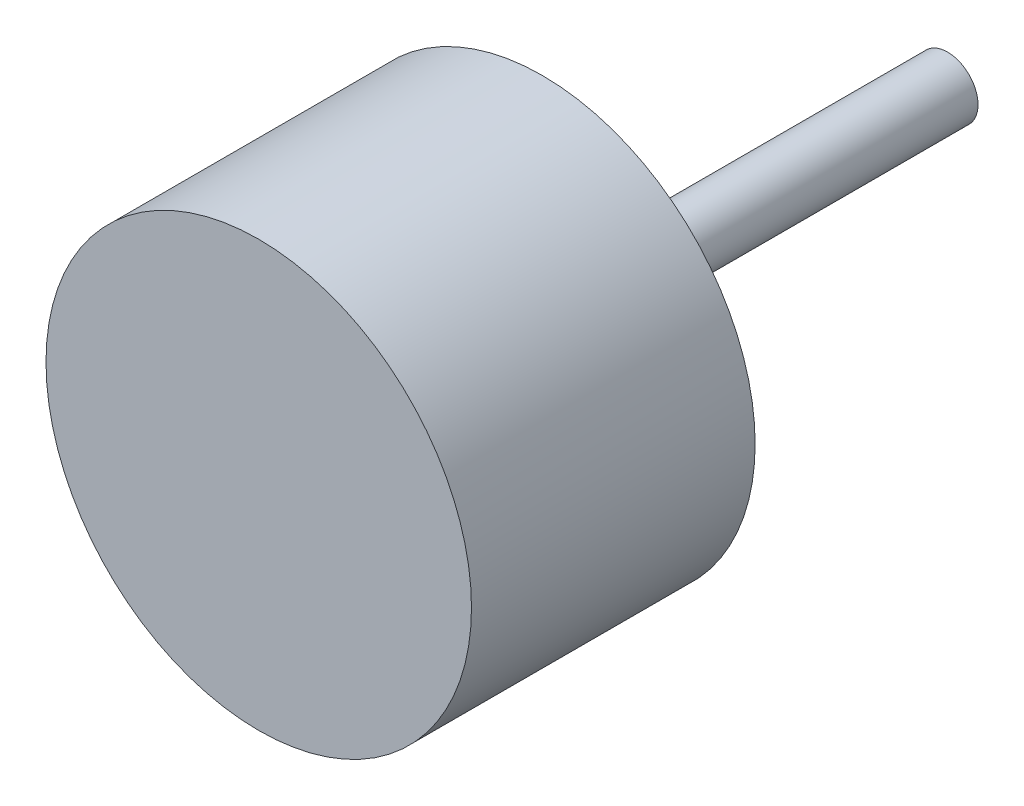
ISO-10303-21;
HEADER;
FILE_DESCRIPTION(('STEP AP214'),'2;1');
FILE_NAME('part.step','',(''),(''),'','','');
FILE_SCHEMA(('AUTOMOTIVE_DESIGN { 1 0 10303 214 1 1 1 1 }'));
ENDSEC;
DATA;
#1=APPLICATION_CONTEXT('core data for automotive mechanical design processes');
#2=APPLICATION_PROTOCOL_DEFINITION('international standard','automotive_design',2000,#1);
#3=PRODUCT_CONTEXT('',#1,'mechanical');
#4=PRODUCT('Part','Part','',(#3));
#5=PRODUCT_RELATED_PRODUCT_CATEGORY('part','',(#4));
#6=PRODUCT_DEFINITION_FORMATION('','',#4);
#7=PRODUCT_DEFINITION_CONTEXT('part definition',#1,'design');
#8=PRODUCT_DEFINITION('design','',#6,#7);
#9=PRODUCT_DEFINITION_SHAPE('','',#8);
#10=(LENGTH_UNIT() NAMED_UNIT(*) SI_UNIT(.MILLI.,.METRE.));
#11=(NAMED_UNIT(*) PLANE_ANGLE_UNIT() SI_UNIT($,.RADIAN.));
#12=(NAMED_UNIT(*) SI_UNIT($,.STERADIAN.) SOLID_ANGLE_UNIT());
#13=UNCERTAINTY_MEASURE_WITH_UNIT(LENGTH_MEASURE(1.E-05),#10,'distance_accuracy_value','');
#14=(GEOMETRIC_REPRESENTATION_CONTEXT(3) GLOBAL_UNCERTAINTY_ASSIGNED_CONTEXT((#13)) GLOBAL_UNIT_ASSIGNED_CONTEXT((#10,
#11,#12)) REPRESENTATION_CONTEXT('',''));
#15=CARTESIAN_POINT('',(0.,0.,0.));
#16=DIRECTION('',(0.,0.,1.));
#17=DIRECTION('',(1.,0.,0.));
#18=AXIS2_PLACEMENT_3D('',#15,#16,#17);
#19=CARTESIAN_POINT('',(0.,0.,14.));
#20=DIRECTION('',(0.,0.,-1.));
#21=DIRECTION('',(-1.,0.,0.));
#22=AXIS2_PLACEMENT_3D('',#19,#20,#21);
#23=CYLINDRICAL_SURFACE('',#22,10.5);
#24=CARTESIAN_POINT('',(0.,0.,14.));
#25=DIRECTION('',(0.,0.,1.));
#26=DIRECTION('',(1.,0.,0.));
#27=AXIS2_PLACEMENT_3D('',#24,#25,#26);
#28=CIRCLE('',#27,10.5);
#29=CARTESIAN_POINT('',(10.5,0.,14.));
#30=VERTEX_POINT('',#29);
#31=EDGE_CURVE('E37',#30,#30,#28,.T.);
#32=ORIENTED_EDGE('',*,*,#31,.F.);
#33=EDGE_LOOP('',(#32));
#34=FACE_BOUND('',#33,.T.);
#35=CARTESIAN_POINT('',(0.,0.,0.));
#36=DIRECTION('',(0.,0.,1.));
#37=DIRECTION('',(1.,0.,0.));
#38=AXIS2_PLACEMENT_3D('',#35,#36,#37);
#39=CIRCLE('',#38,10.5);
#40=CARTESIAN_POINT('',(10.5,0.,0.));
#41=VERTEX_POINT('',#40);
#42=EDGE_CURVE('E41',#41,#41,#39,.T.);
#43=ORIENTED_EDGE('',*,*,#42,.T.);
#44=EDGE_LOOP('',(#43));
#45=FACE_BOUND('',#44,.T.);
#46=ADVANCED_FACE('F31',(#34,#45),#23,.T.);
#47=CARTESIAN_POINT('',(0.,0.,14.));
#48=DIRECTION('',(0.,0.,1.));
#49=DIRECTION('',(1.,0.,0.));
#50=AXIS2_PLACEMENT_3D('',#47,#48,#49);
#51=PLANE('',#50);
#52=ORIENTED_EDGE('',*,*,#31,.T.);
#53=EDGE_LOOP('',(#52));
#54=FACE_BOUND('',#53,.T.);
#55=ADVANCED_FACE('F62',(#54),#51,.T.);
#56=CARTESIAN_POINT('',(0.,0.,0.));
#57=DIRECTION('',(0.,0.,1.));
#58=DIRECTION('',(1.,0.,0.));
#59=AXIS2_PLACEMENT_3D('',#56,#57,#58);
#60=PLANE('',#59);
#61=CARTESIAN_POINT('',(0.,0.,0.));
#62=DIRECTION('',(0.,0.,1.));
#63=DIRECTION('',(1.,0.,0.));
#64=AXIS2_PLACEMENT_3D('',#61,#62,#63);
#65=CIRCLE('',#64,1.5);
#66=CARTESIAN_POINT('',(1.5,0.,0.));
#67=VERTEX_POINT('',#66);
#68=EDGE_CURVE('E10',#67,#67,#65,.F.);
#69=ORIENTED_EDGE('',*,*,#68,.F.);
#70=EDGE_LOOP('',(#69));
#71=FACE_BOUND('',#70,.T.);
#72=ORIENTED_EDGE('',*,*,#42,.F.);
#73=EDGE_LOOP('',(#72));
#74=FACE_BOUND('',#73,.T.);
#75=ADVANCED_FACE('F55',(#71,#74),#60,.F.);
#76=CARTESIAN_POINT('',(0.,0.,-20.));
#77=DIRECTION('',(0.,0.,1.));
#78=DIRECTION('',(1.,0.,0.));
#79=AXIS2_PLACEMENT_3D('',#76,#77,#78);
#80=CYLINDRICAL_SURFACE('',#79,1.5);
#81=CARTESIAN_POINT('',(0.,0.,-20.));
#82=DIRECTION('',(0.,0.,-1.));
#83=DIRECTION('',(-1.,0.,0.));
#84=AXIS2_PLACEMENT_3D('',#81,#82,#83);
#85=CIRCLE('',#84,1.5);
#86=CARTESIAN_POINT('',(-1.5,0.,-20.));
#87=VERTEX_POINT('',#86);
#88=EDGE_CURVE('E46',#87,#87,#85,.T.);
#89=ORIENTED_EDGE('',*,*,#88,.F.);
#90=EDGE_LOOP('',(#89));
#91=FACE_BOUND('',#90,.T.);
#92=ORIENTED_EDGE('',*,*,#68,.T.);
#93=EDGE_LOOP('',(#92));
#94=FACE_BOUND('',#93,.T.);
#95=ADVANCED_FACE('F53',(#91,#94),#80,.T.);
#96=CARTESIAN_POINT('',(0.,0.,-20.));
#97=DIRECTION('',(0.,0.,-1.));
#98=DIRECTION('',(-1.,0.,0.));
#99=AXIS2_PLACEMENT_3D('',#96,#97,#98);
#100=PLANE('',#99);
#101=ORIENTED_EDGE('',*,*,#88,.T.);
#102=EDGE_LOOP('',(#101));
#103=FACE_BOUND('',#102,.T.);
#104=ADVANCED_FACE('F51',(#103),#100,.T.);
#105=CLOSED_SHELL('',(#46,#55,#75,#95,#104));
#106=MANIFOLD_SOLID_BREP('B2',#105);
#107=ADVANCED_BREP_SHAPE_REPRESENTATION('',(#18,#106),#14);
#108=SHAPE_DEFINITION_REPRESENTATION(#9,#107);
ENDSEC;
END-ISO-10303-21;
